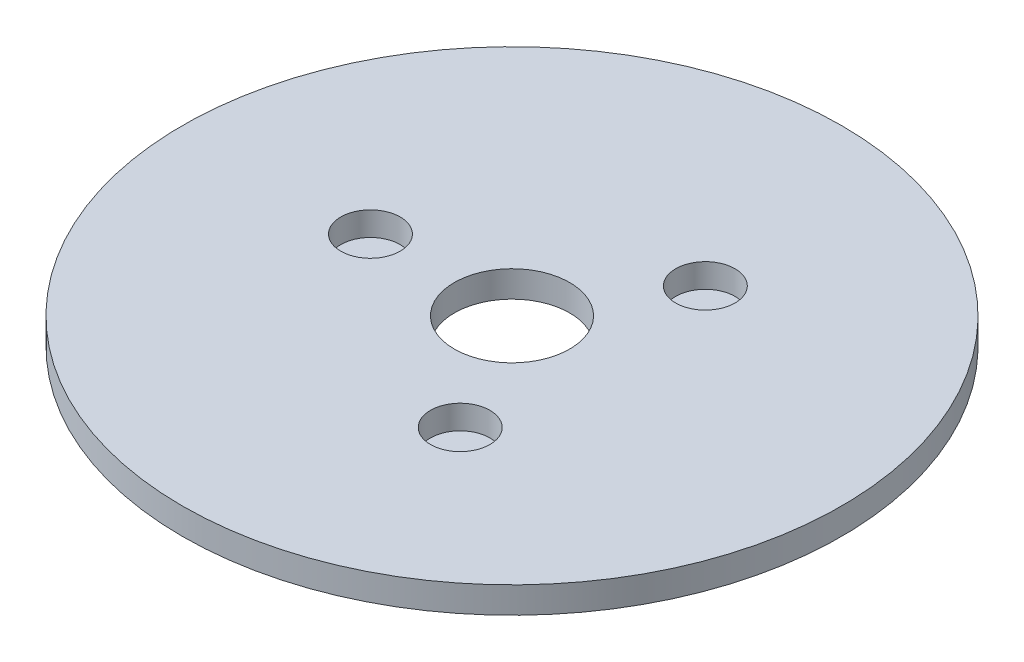
ISO-10303-21;
HEADER;
FILE_DESCRIPTION(('STEP AP214'),'2;1');
FILE_NAME('part.step','',(''),(''),'','','');
FILE_SCHEMA(('AUTOMOTIVE_DESIGN { 1 0 10303 214 1 1 1 1 }'));
ENDSEC;
DATA;
#1=APPLICATION_CONTEXT('core data for automotive mechanical design processes');
#2=APPLICATION_PROTOCOL_DEFINITION('international standard','automotive_design',2000,#1);
#3=PRODUCT_CONTEXT('',#1,'mechanical');
#4=PRODUCT('Part','Part','',(#3));
#5=PRODUCT_RELATED_PRODUCT_CATEGORY('part','',(#4));
#6=PRODUCT_DEFINITION_FORMATION('','',#4);
#7=PRODUCT_DEFINITION_CONTEXT('part definition',#1,'design');
#8=PRODUCT_DEFINITION('design','',#6,#7);
#9=PRODUCT_DEFINITION_SHAPE('','',#8);
#10=(LENGTH_UNIT() NAMED_UNIT(*) SI_UNIT(.MILLI.,.METRE.));
#11=(NAMED_UNIT(*) PLANE_ANGLE_UNIT() SI_UNIT($,.RADIAN.));
#12=(NAMED_UNIT(*) SI_UNIT($,.STERADIAN.) SOLID_ANGLE_UNIT());
#13=UNCERTAINTY_MEASURE_WITH_UNIT(LENGTH_MEASURE(1.E-05),#10,'distance_accuracy_value','');
#14=(GEOMETRIC_REPRESENTATION_CONTEXT(3) GLOBAL_UNCERTAINTY_ASSIGNED_CONTEXT((#13)) GLOBAL_UNIT_ASSIGNED_CONTEXT((#10,
#11,#12)) REPRESENTATION_CONTEXT('',''));
#15=CARTESIAN_POINT('',(0.,0.,0.));
#16=DIRECTION('',(0.,0.,1.));
#17=DIRECTION('',(1.,0.,0.));
#18=AXIS2_PLACEMENT_3D('',#15,#16,#17);
#19=CARTESIAN_POINT('',(0.,8.,0.));
#20=DIRECTION('',(0.,-1.,0.));
#21=DIRECTION('',(0.,0.,-1.));
#22=AXIS2_PLACEMENT_3D('',#19,#20,#21);
#23=CYLINDRICAL_SURFACE('',#22,100.);
#24=CARTESIAN_POINT('',(0.,8.,0.));
#25=DIRECTION('',(0.,1.,0.));
#26=DIRECTION('',(0.,0.,1.));
#27=AXIS2_PLACEMENT_3D('',#24,#25,#26);
#28=CIRCLE('',#27,100.);
#29=CARTESIAN_POINT('',(0.,8.,100.));
#30=VERTEX_POINT('',#29);
#31=EDGE_CURVE('E10',#30,#30,#28,.T.);
#32=ORIENTED_EDGE('',*,*,#31,.F.);
#33=EDGE_LOOP('',(#32));
#34=FACE_BOUND('',#33,.T.);
#35=CARTESIAN_POINT('',(0.,0.,0.));
#36=DIRECTION('',(0.,1.,0.));
#37=DIRECTION('',(0.,0.,1.));
#38=AXIS2_PLACEMENT_3D('',#35,#36,#37);
#39=CIRCLE('',#38,100.);
#40=CARTESIAN_POINT('',(0.,0.,100.));
#41=VERTEX_POINT('',#40);
#42=EDGE_CURVE('E37',#41,#41,#39,.T.);
#43=ORIENTED_EDGE('',*,*,#42,.T.);
#44=EDGE_LOOP('',(#43));
#45=FACE_BOUND('',#44,.T.);
#46=ADVANCED_FACE('F40',(#34,#45),#23,.T.);
#47=CARTESIAN_POINT('',(0.,8.,0.));
#48=DIRECTION('',(0.,1.,0.));
#49=DIRECTION('',(0.,0.,1.));
#50=AXIS2_PLACEMENT_3D('',#47,#48,#49);
#51=PLANE('',#50);
#52=CARTESIAN_POINT('',(21.4740104758311,8.,37.1940771864054));
#53=DIRECTION('',(0.,1.,0.));
#54=DIRECTION('',(0.866025403784436,0.,-0.500000000000004));
#55=AXIS2_PLACEMENT_3D('',#52,#53,#54);
#56=CIRCLE('',#55,9.00987688887844);
#57=CARTESIAN_POINT('',(29.2767927465701,8.,32.6891387419662));
#58=VERTEX_POINT('',#57);
#59=EDGE_CURVE('E70',#58,#58,#56,.T.);
#60=ORIENTED_EDGE('',*,*,#59,.F.);
#61=EDGE_LOOP('',(#60));
#62=FACE_BOUND('',#61,.T.);
#63=CARTESIAN_POINT('',(21.4740104758306,8.,-37.1940771864057));
#64=DIRECTION('',(0.,1.,0.));
#65=DIRECTION('',(-0.866025403784443,0.,-0.499999999999992));
#66=AXIS2_PLACEMENT_3D('',#63,#64,#65);
#67=CIRCLE('',#66,9.00987688887844);
#68=CARTESIAN_POINT('',(13.6712282050915,8.,-41.6990156308449));
#69=VERTEX_POINT('',#68);
#70=EDGE_CURVE('E61',#69,#69,#67,.T.);
#71=ORIENTED_EDGE('',*,*,#70,.F.);
#72=EDGE_LOOP('',(#71));
#73=FACE_BOUND('',#72,.T.);
#74=CARTESIAN_POINT('',(-42.9480209516619,8.,0.));
#75=DIRECTION('',(0.,1.,0.));
#76=DIRECTION('',(0.,0.,1.));
#77=AXIS2_PLACEMENT_3D('',#74,#75,#76);
#78=CIRCLE('',#77,9.00987688887844);
#79=CARTESIAN_POINT('',(-42.9480209516619,8.,9.00987688887844));
#80=VERTEX_POINT('',#79);
#81=EDGE_CURVE('E54',#80,#80,#78,.T.);
#82=ORIENTED_EDGE('',*,*,#81,.F.);
#83=EDGE_LOOP('',(#82));
#84=FACE_BOUND('',#83,.T.);
#85=CARTESIAN_POINT('',(0.,8.,0.));
#86=DIRECTION('',(0.,1.,0.));
#87=DIRECTION('',(0.,0.,1.));
#88=AXIS2_PLACEMENT_3D('',#85,#86,#87);
#89=CIRCLE('',#88,17.5);
#90=CARTESIAN_POINT('',(0.,8.,17.5));
#91=VERTEX_POINT('',#90);
#92=EDGE_CURVE('E50',#91,#91,#89,.T.);
#93=ORIENTED_EDGE('',*,*,#92,.F.);
#94=EDGE_LOOP('',(#93));
#95=FACE_BOUND('',#94,.T.);
#96=ORIENTED_EDGE('',*,*,#31,.T.);
#97=EDGE_LOOP('',(#96));
#98=FACE_BOUND('',#97,.T.);
#99=ADVANCED_FACE('F85',(#62,#73,#84,#95,#98),#51,.T.);
#100=CARTESIAN_POINT('',(0.,0.,0.));
#101=DIRECTION('',(0.,1.,0.));
#102=DIRECTION('',(0.,0.,1.));
#103=AXIS2_PLACEMENT_3D('',#100,#101,#102);
#104=PLANE('',#103);
#105=CARTESIAN_POINT('',(0.,0.,0.));
#106=DIRECTION('',(0.,1.,0.));
#107=DIRECTION('',(0.,0.,1.));
#108=AXIS2_PLACEMENT_3D('',#105,#106,#107);
#109=CIRCLE('',#108,17.5);
#110=CARTESIAN_POINT('',(0.,0.,17.5));
#111=VERTEX_POINT('',#110);
#112=EDGE_CURVE('E47',#111,#111,#109,.T.);
#113=ORIENTED_EDGE('',*,*,#112,.T.);
#114=EDGE_LOOP('',(#113));
#115=FACE_BOUND('',#114,.T.);
#116=ORIENTED_EDGE('',*,*,#42,.F.);
#117=EDGE_LOOP('',(#116));
#118=FACE_BOUND('',#117,.T.);
#119=ADVANCED_FACE('F84',(#115,#118),#104,.F.);
#120=CARTESIAN_POINT('',(0.,8.,0.));
#121=DIRECTION('',(0.,-1.,0.));
#122=DIRECTION('',(0.,0.,-1.));
#123=AXIS2_PLACEMENT_3D('',#120,#121,#122);
#124=CYLINDRICAL_SURFACE('',#123,17.5);
#125=ORIENTED_EDGE('',*,*,#92,.T.);
#126=EDGE_LOOP('',(#125));
#127=FACE_BOUND('',#126,.T.);
#128=ORIENTED_EDGE('',*,*,#112,.F.);
#129=EDGE_LOOP('',(#128));
#130=FACE_BOUND('',#129,.T.);
#131=ADVANCED_FACE('F91',(#127,#130),#124,.F.);
#132=CARTESIAN_POINT('',(-42.9480209516619,0.730659227171693,0.));
#133=DIRECTION('',(0.,1.,0.));
#134=DIRECTION('',(0.,0.,1.));
#135=AXIS2_PLACEMENT_3D('',#132,#133,#134);
#136=CYLINDRICAL_SURFACE('',#135,9.00987688887844);
#137=CARTESIAN_POINT('',(-42.9480209516619,0.730659227171693,0.));
#138=DIRECTION('',(0.,1.,0.));
#139=DIRECTION('',(0.,0.,1.));
#140=AXIS2_PLACEMENT_3D('',#137,#138,#139);
#141=CIRCLE('',#140,9.00987688887844);
#142=CARTESIAN_POINT('',(-42.9480209516619,0.730659227171693,9.00987688887844));
#143=VERTEX_POINT('',#142);
#144=EDGE_CURVE('E55',#143,#143,#141,.T.);
#145=ORIENTED_EDGE('',*,*,#144,.F.);
#146=EDGE_LOOP('',(#145));
#147=FACE_BOUND('',#146,.T.);
#148=ORIENTED_EDGE('',*,*,#81,.T.);
#149=EDGE_LOOP('',(#148));
#150=FACE_BOUND('',#149,.T.);
#151=ADVANCED_FACE('F96',(#147,#150),#136,.F.);
#152=CARTESIAN_POINT('',(-42.9480209516619,0.730659227171693,0.));
#153=DIRECTION('',(0.,1.,0.));
#154=DIRECTION('',(0.,0.,1.));
#155=AXIS2_PLACEMENT_3D('',#152,#153,#154);
#156=PLANE('',#155);
#157=ORIENTED_EDGE('',*,*,#144,.T.);
#158=EDGE_LOOP('',(#157));
#159=FACE_BOUND('',#158,.T.);
#160=ADVANCED_FACE('F127',(#159),#156,.T.);
#161=CARTESIAN_POINT('',(21.4740104758306,0.730659227171693,-37.1940771864057));
#162=DIRECTION('',(0.,1.,0.));
#163=DIRECTION('',(0.,0.,1.));
#164=AXIS2_PLACEMENT_3D('',#161,#162,#163);
#165=CYLINDRICAL_SURFACE('',#164,9.00987688887844);
#166=CARTESIAN_POINT('',(21.4740104758306,0.730659227171693,-37.1940771864057));
#167=DIRECTION('',(0.,1.,0.));
#168=DIRECTION('',(-0.866025403784443,0.,-0.499999999999992));
#169=AXIS2_PLACEMENT_3D('',#166,#167,#168);
#170=CIRCLE('',#169,9.00987688887844);
#171=CARTESIAN_POINT('',(13.6712282050915,0.730659227171693,-41.6990156308449));
#172=VERTEX_POINT('',#171);
#173=EDGE_CURVE('E63',#172,#172,#170,.T.);
#174=ORIENTED_EDGE('',*,*,#173,.F.);
#175=EDGE_LOOP('',(#174));
#176=FACE_BOUND('',#175,.T.);
#177=ORIENTED_EDGE('',*,*,#70,.T.);
#178=EDGE_LOOP('',(#177));
#179=FACE_BOUND('',#178,.T.);
#180=ADVANCED_FACE('F133',(#176,#179),#165,.F.);
#181=CARTESIAN_POINT('',(21.4740104758306,0.730659227171693,-37.1940771864057));
#182=DIRECTION('',(0.,1.,0.));
#183=DIRECTION('',(-0.866025403784443,0.,-0.499999999999992));
#184=AXIS2_PLACEMENT_3D('',#181,#182,#183);
#185=PLANE('',#184);
#186=ORIENTED_EDGE('',*,*,#173,.T.);
#187=EDGE_LOOP('',(#186));
#188=FACE_BOUND('',#187,.T.);
#189=ADVANCED_FACE('F77',(#188),#185,.T.);
#190=CARTESIAN_POINT('',(21.4740104758311,0.730659227171693,37.1940771864054));
#191=DIRECTION('',(0.,1.,0.));
#192=DIRECTION('',(0.,0.,1.));
#193=AXIS2_PLACEMENT_3D('',#190,#191,#192);
#194=CYLINDRICAL_SURFACE('',#193,9.00987688887844);
#195=CARTESIAN_POINT('',(21.4740104758311,0.730659227171693,37.1940771864054));
#196=DIRECTION('',(0.,1.,0.));
#197=DIRECTION('',(0.866025403784436,0.,-0.500000000000004));
#198=AXIS2_PLACEMENT_3D('',#195,#196,#197);
#199=CIRCLE('',#198,9.00987688887844);
#200=CARTESIAN_POINT('',(29.2767927465701,0.730659227171693,32.6891387419662));
#201=VERTEX_POINT('',#200);
#202=EDGE_CURVE('E59',#201,#201,#199,.T.);
#203=ORIENTED_EDGE('',*,*,#202,.F.);
#204=EDGE_LOOP('',(#203));
#205=FACE_BOUND('',#204,.T.);
#206=ORIENTED_EDGE('',*,*,#59,.T.);
#207=EDGE_LOOP('',(#206));
#208=FACE_BOUND('',#207,.T.);
#209=ADVANCED_FACE('F73',(#205,#208),#194,.F.);
#210=CARTESIAN_POINT('',(21.4740104758311,0.730659227171693,37.1940771864054));
#211=DIRECTION('',(0.,1.,0.));
#212=DIRECTION('',(0.866025403784436,0.,-0.500000000000004));
#213=AXIS2_PLACEMENT_3D('',#210,#211,#212);
#214=PLANE('',#213);
#215=ORIENTED_EDGE('',*,*,#202,.T.);
#216=EDGE_LOOP('',(#215));
#217=FACE_BOUND('',#216,.T.);
#218=ADVANCED_FACE('F71',(#217),#214,.T.);
#219=CLOSED_SHELL('',(#46,#99,#119,#131,#151,#160,#180,#189,#209,#218));
#220=MANIFOLD_SOLID_BREP('B2',#219);
#221=ADVANCED_BREP_SHAPE_REPRESENTATION('',(#18,#220),#14);
#222=SHAPE_DEFINITION_REPRESENTATION(#9,#221);
ENDSEC;
END-ISO-10303-21;
